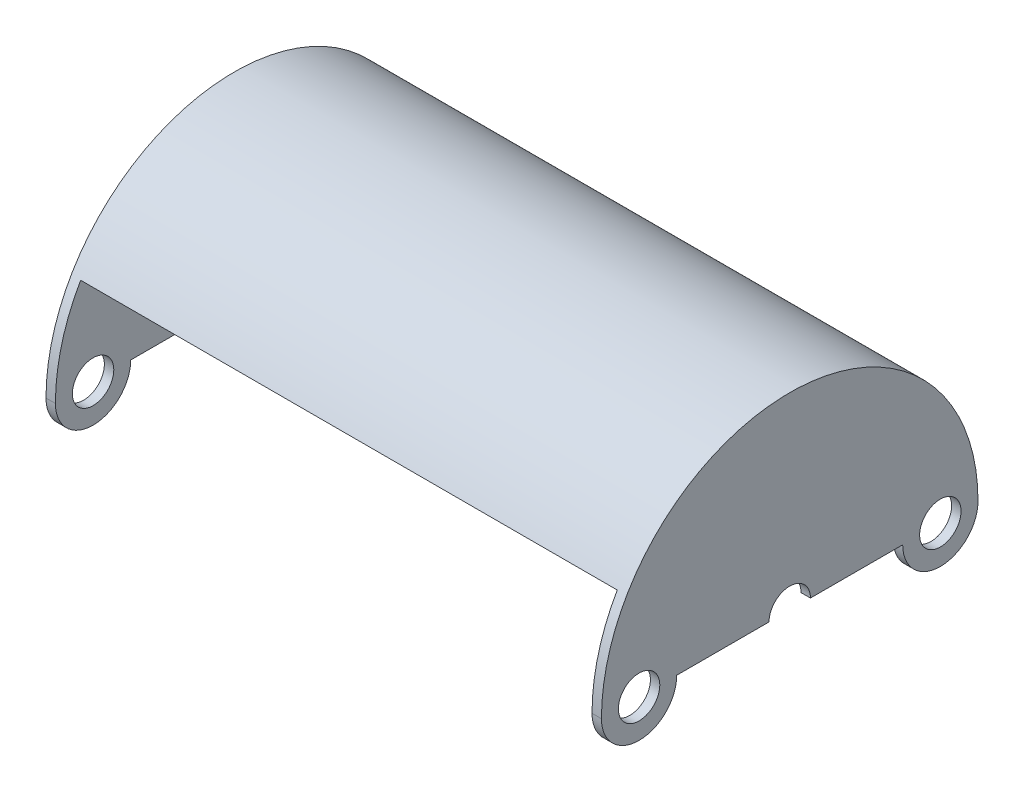
ISO-10303-21;
HEADER;
FILE_DESCRIPTION(('STEP AP214'),'2;1');
FILE_NAME('part.step','',(''),(''),'','','');
FILE_SCHEMA(('AUTOMOTIVE_DESIGN { 1 0 10303 214 1 1 1 1 }'));
ENDSEC;
DATA;
#1=APPLICATION_CONTEXT('core data for automotive mechanical design processes');
#2=APPLICATION_PROTOCOL_DEFINITION('international standard','automotive_design',2000,#1);
#3=PRODUCT_CONTEXT('',#1,'mechanical');
#4=PRODUCT('Part','Part','',(#3));
#5=PRODUCT_RELATED_PRODUCT_CATEGORY('part','',(#4));
#6=PRODUCT_DEFINITION_FORMATION('','',#4);
#7=PRODUCT_DEFINITION_CONTEXT('part definition',#1,'design');
#8=PRODUCT_DEFINITION('design','',#6,#7);
#9=PRODUCT_DEFINITION_SHAPE('','',#8);
#10=(LENGTH_UNIT() NAMED_UNIT(*) SI_UNIT(.MILLI.,.METRE.));
#11=(NAMED_UNIT(*) PLANE_ANGLE_UNIT() SI_UNIT($,.RADIAN.));
#12=(NAMED_UNIT(*) SI_UNIT($,.STERADIAN.) SOLID_ANGLE_UNIT());
#13=UNCERTAINTY_MEASURE_WITH_UNIT(LENGTH_MEASURE(1.E-05),#10,'distance_accuracy_value','');
#14=(GEOMETRIC_REPRESENTATION_CONTEXT(3) GLOBAL_UNCERTAINTY_ASSIGNED_CONTEXT((#13)) GLOBAL_UNIT_ASSIGNED_CONTEXT((#10,
#11,#12)) REPRESENTATION_CONTEXT('',''));
#15=CARTESIAN_POINT('',(0.,0.,0.));
#16=DIRECTION('',(0.,0.,1.));
#17=DIRECTION('',(1.,0.,0.));
#18=AXIS2_PLACEMENT_3D('',#15,#16,#17);
#19=CARTESIAN_POINT('',(45.24375,0.,0.));
#20=DIRECTION('',(-1.,0.,0.));
#21=DIRECTION('',(0.,0.,1.));
#22=AXIS2_PLACEMENT_3D('',#19,#20,#21);
#23=CYLINDRICAL_SURFACE('',#22,30.1625);
#24=CARTESIAN_POINT('',(-45.24375,0.,0.));
#25=DIRECTION('',(1.,0.,0.));
#26=DIRECTION('',(0.,0.,-1.));
#27=AXIS2_PLACEMENT_3D('',#24,#25,#26);
#28=CIRCLE('',#27,30.1625);
#29=CARTESIAN_POINT('',(-45.24375,0.,-30.1625));
#30=VERTEX_POINT('',#29);
#31=CARTESIAN_POINT('',(-45.24375,15.0812499999998,26.1214912416482));
#32=VERTEX_POINT('',#31);
#33=EDGE_CURVE('E308',#30,#32,#28,.T.);
#34=ORIENTED_EDGE('',*,*,#33,.F.);
#35=DIRECTION('',(-1.,0.,0.));
#36=VECTOR('',#35,1.);
#37=CARTESIAN_POINT('',(45.24375,0.,-30.1625));
#38=LINE('',#37,#36);
#39=CARTESIAN_POINT('',(45.24375,0.,-30.1625));
#40=VERTEX_POINT('',#39);
#41=EDGE_CURVE('E11',#40,#30,#38,.T.);
#42=ORIENTED_EDGE('',*,*,#41,.F.);
#43=CARTESIAN_POINT('',(45.24375,0.,0.));
#44=DIRECTION('',(1.,0.,0.));
#45=DIRECTION('',(0.,0.,-1.));
#46=AXIS2_PLACEMENT_3D('',#43,#44,#45);
#47=CIRCLE('',#46,30.1625);
#48=CARTESIAN_POINT('',(45.24375,15.0812499999998,26.1214912416482));
#49=VERTEX_POINT('',#48);
#50=EDGE_CURVE('E309',#40,#49,#47,.T.);
#51=ORIENTED_EDGE('',*,*,#50,.T.);
#52=DIRECTION('',(-1.,0.,0.));
#53=VECTOR('',#52,1.);
#54=CARTESIAN_POINT('',(45.24375,15.0812499999998,26.1214912416482));
#55=LINE('',#54,#53);
#56=EDGE_CURVE('E321',#49,#32,#55,.T.);
#57=ORIENTED_EDGE('',*,*,#56,.T.);
#58=EDGE_LOOP('',(#34,#42,#51,#57));
#59=FACE_BOUND('',#58,.T.);
#60=ADVANCED_FACE('F47',(#59),#23,.F.);
#61=CARTESIAN_POINT('',(45.24375,0.,0.));
#62=DIRECTION('',(0.,1.,0.));
#63=DIRECTION('',(0.,0.,1.));
#64=AXIS2_PLACEMENT_3D('',#61,#62,#63);
#65=PLANE('',#64);
#66=DIRECTION('',(0.,0.,-1.));
#67=VECTOR('',#66,1.);
#68=CARTESIAN_POINT('',(-45.24375,0.,0.));
#69=LINE('',#68,#67);
#70=CARTESIAN_POINT('',(-45.24375,0.,-31.75));
#71=VERTEX_POINT('',#70);
#72=EDGE_CURVE('E324',#30,#71,#69,.T.);
#73=ORIENTED_EDGE('',*,*,#72,.T.);
#74=DIRECTION('',(-1.,0.,0.));
#75=VECTOR('',#74,1.);
#76=CARTESIAN_POINT('',(45.24375,0.,-31.75));
#77=LINE('',#76,#75);
#78=CARTESIAN_POINT('',(45.24375,0.,-31.75));
#79=VERTEX_POINT('',#78);
#80=EDGE_CURVE('E56',#79,#71,#77,.T.);
#81=ORIENTED_EDGE('',*,*,#80,.F.);
#82=DIRECTION('',(0.,0.,-1.));
#83=VECTOR('',#82,1.);
#84=CARTESIAN_POINT('',(45.24375,0.,0.));
#85=LINE('',#84,#83);
#86=EDGE_CURVE('E313',#40,#79,#85,.T.);
#87=ORIENTED_EDGE('',*,*,#86,.F.);
#88=ORIENTED_EDGE('',*,*,#41,.T.);
#89=EDGE_LOOP('',(#73,#81,#87,#88));
#90=FACE_BOUND('',#89,.T.);
#91=ADVANCED_FACE('F342',(#90),#65,.F.);
#92=CARTESIAN_POINT('',(45.24375,0.,0.));
#93=DIRECTION('',(-1.,0.,0.));
#94=DIRECTION('',(0.,0.,1.));
#95=AXIS2_PLACEMENT_3D('',#92,#93,#94);
#96=CYLINDRICAL_SURFACE('',#95,31.75);
#97=ORIENTED_EDGE('',*,*,#80,.T.);
#98=DIRECTION('',(1.,0.,0.));
#99=VECTOR('',#98,1.);
#100=CARTESIAN_POINT('',(-46.83125,0.,-31.75));
#101=LINE('',#100,#99);
#102=CARTESIAN_POINT('',(-46.83125,0.,-31.75));
#103=VERTEX_POINT('',#102);
#104=EDGE_CURVE('E163',#103,#71,#101,.T.);
#105=ORIENTED_EDGE('',*,*,#104,.F.);
#106=CARTESIAN_POINT('',(-46.83125,0.,0.));
#107=DIRECTION('',(1.,0.,0.));
#108=DIRECTION('',(0.,0.,-1.));
#109=AXIS2_PLACEMENT_3D('',#106,#107,#108);
#110=CIRCLE('',#109,31.75);
#111=CARTESIAN_POINT('',(-46.83125,-2.78108394667497E-13,31.75));
#112=VERTEX_POINT('',#111);
#113=EDGE_CURVE('E169',#103,#112,#110,.T.);
#114=ORIENTED_EDGE('',*,*,#113,.T.);
#115=DIRECTION('',(1.,0.,0.));
#116=VECTOR('',#115,1.);
#117=CARTESIAN_POINT('',(-46.83125,-2.78108394667497E-13,31.75));
#118=LINE('',#117,#116);
#119=CARTESIAN_POINT('',(-45.24375,-2.78108394667497E-13,31.75));
#120=VERTEX_POINT('',#119);
#121=EDGE_CURVE('E151',#112,#120,#118,.T.);
#122=ORIENTED_EDGE('',*,*,#121,.T.);
#123=CARTESIAN_POINT('',(-45.24375,0.,0.));
#124=DIRECTION('',(1.,0.,0.));
#125=DIRECTION('',(0.,0.,-1.));
#126=AXIS2_PLACEMENT_3D('',#123,#124,#125);
#127=CIRCLE('',#126,31.75);
#128=CARTESIAN_POINT('',(-45.24375,15.8749999999998,27.496306570156));
#129=VERTEX_POINT('',#128);
#130=EDGE_CURVE('E200',#129,#120,#127,.T.);
#131=ORIENTED_EDGE('',*,*,#130,.F.);
#132=DIRECTION('',(-1.,0.,0.));
#133=VECTOR('',#132,1.);
#134=CARTESIAN_POINT('',(45.24375,15.8749999999998,27.496306570156));
#135=LINE('',#134,#133);
#136=CARTESIAN_POINT('',(45.24375,15.8749999999998,27.496306570156));
#137=VERTEX_POINT('',#136);
#138=EDGE_CURVE('E333',#137,#129,#135,.T.);
#139=ORIENTED_EDGE('',*,*,#138,.F.);
#140=CARTESIAN_POINT('',(45.24375,0.,0.));
#141=DIRECTION('',(1.,0.,0.));
#142=DIRECTION('',(0.,0.,-1.));
#143=AXIS2_PLACEMENT_3D('',#140,#141,#142);
#144=CIRCLE('',#143,31.75);
#145=CARTESIAN_POINT('',(45.24375,-2.78108394667497E-13,31.75));
#146=VERTEX_POINT('',#145);
#147=EDGE_CURVE('E62',#137,#146,#144,.T.);
#148=ORIENTED_EDGE('',*,*,#147,.T.);
#149=DIRECTION('',(-1.,0.,0.));
#150=VECTOR('',#149,1.);
#151=CARTESIAN_POINT('',(46.83125,-2.78108394667497E-13,31.75));
#152=LINE('',#151,#150);
#153=CARTESIAN_POINT('',(46.83125,-2.78108394667497E-13,31.75));
#154=VERTEX_POINT('',#153);
#155=EDGE_CURVE('E266',#154,#146,#152,.T.);
#156=ORIENTED_EDGE('',*,*,#155,.F.);
#157=CARTESIAN_POINT('',(46.83125,0.,0.));
#158=DIRECTION('',(1.,0.,0.));
#159=DIRECTION('',(0.,0.,-1.));
#160=AXIS2_PLACEMENT_3D('',#157,#158,#159);
#161=CIRCLE('',#160,31.75);
#162=CARTESIAN_POINT('',(46.83125,0.,-31.75));
#163=VERTEX_POINT('',#162);
#164=EDGE_CURVE('E263',#163,#154,#161,.T.);
#165=ORIENTED_EDGE('',*,*,#164,.F.);
#166=DIRECTION('',(-1.,0.,0.));
#167=VECTOR('',#166,1.);
#168=CARTESIAN_POINT('',(46.83125,0.,-31.75));
#169=LINE('',#168,#167);
#170=EDGE_CURVE('E288',#163,#79,#169,.T.);
#171=ORIENTED_EDGE('',*,*,#170,.T.);
#172=EDGE_LOOP('',(#97,#105,#114,#122,#131,#139,#148,#156,#165,#171));
#173=FACE_BOUND('',#172,.T.);
#174=ADVANCED_FACE('F178',(#173),#96,.T.);
#175=CARTESIAN_POINT('',(45.24375,0.,0.));
#176=DIRECTION('',(0.,-0.866025403784442,0.499999999999995));
#177=DIRECTION('',(0.,-0.499999999999995,-0.866025403784442));
#178=AXIS2_PLACEMENT_3D('',#175,#176,#177);
#179=PLANE('',#178);
#180=DIRECTION('',(0.,0.499999999999995,0.866025403784442));
#181=VECTOR('',#180,1.);
#182=CARTESIAN_POINT('',(-45.24375,0.,0.));
#183=LINE('',#182,#181);
#184=EDGE_CURVE('E314',#32,#129,#183,.T.);
#185=ORIENTED_EDGE('',*,*,#184,.F.);
#186=ORIENTED_EDGE('',*,*,#56,.F.);
#187=DIRECTION('',(0.,0.499999999999995,0.866025403784442));
#188=VECTOR('',#187,1.);
#189=CARTESIAN_POINT('',(45.24375,0.,0.));
#190=LINE('',#189,#188);
#191=EDGE_CURVE('E317',#49,#137,#190,.T.);
#192=ORIENTED_EDGE('',*,*,#191,.T.);
#193=ORIENTED_EDGE('',*,*,#138,.T.);
#194=EDGE_LOOP('',(#185,#186,#192,#193));
#195=FACE_BOUND('',#194,.T.);
#196=ADVANCED_FACE('F362',(#195),#179,.T.);
#197=CARTESIAN_POINT('',(46.83125,-2.24086679090653E-13,25.4));
#198=DIRECTION('',(1.,0.,0.));
#199=DIRECTION('',(0.,0.,-1.));
#200=AXIS2_PLACEMENT_3D('',#197,#198,#199);
#201=PLANE('',#200);
#202=CARTESIAN_POINT('',(46.83125,-2.24086679090653E-13,25.4));
#203=DIRECTION('',(1.,0.,0.));
#204=DIRECTION('',(0.,0.,-1.));
#205=AXIS2_PLACEMENT_3D('',#202,#203,#204);
#206=CIRCLE('',#205,3.4925);
#207=CARTESIAN_POINT('',(46.83125,-2.24086679090653E-13,21.9075));
#208=VERTEX_POINT('',#207);
#209=EDGE_CURVE('E239',#208,#208,#206,.T.);
#210=ORIENTED_EDGE('',*,*,#209,.F.);
#211=EDGE_LOOP('',(#210));
#212=FACE_BOUND('',#211,.T.);
#213=CARTESIAN_POINT('',(46.83125,-2.24086679090653E-13,25.4));
#214=DIRECTION('',(1.,0.,0.));
#215=DIRECTION('',(0.,0.,-1.));
#216=AXIS2_PLACEMENT_3D('',#213,#214,#215);
#217=CIRCLE('',#216,6.35);
#218=CARTESIAN_POINT('',(46.83125,-2.24086679090653E-13,19.05));
#219=VERTEX_POINT('',#218);
#220=EDGE_CURVE('E247',#154,#219,#217,.T.);
#221=ORIENTED_EDGE('',*,*,#220,.T.);
#222=DIRECTION('',(0.,0.,-1.));
#223=VECTOR('',#222,1.);
#224=CARTESIAN_POINT('',(46.83125,-2.24086679090653E-13,19.05));
#225=LINE('',#224,#223);
#226=CARTESIAN_POINT('',(46.83125,-1.32584618461969E-13,3.4925));
#227=VERTEX_POINT('',#226);
#228=EDGE_CURVE('E251',#219,#227,#225,.T.);
#229=ORIENTED_EDGE('',*,*,#228,.T.);
#230=CARTESIAN_POINT('',(46.83125,0.,0.));
#231=DIRECTION('',(-1.,0.,0.));
#232=DIRECTION('',(0.,0.,-1.));
#233=AXIS2_PLACEMENT_3D('',#230,#231,#232);
#234=CIRCLE('',#233,3.4925);
#235=CARTESIAN_POINT('',(46.83125,0.,-3.4925));
#236=VERTEX_POINT('',#235);
#237=EDGE_CURVE('E254',#227,#236,#234,.T.);
#238=ORIENTED_EDGE('',*,*,#237,.T.);
#239=DIRECTION('',(0.,0.,-1.));
#240=VECTOR('',#239,1.);
#241=CARTESIAN_POINT('',(46.83125,0.,-3.4925));
#242=LINE('',#241,#240);
#243=CARTESIAN_POINT('',(46.83125,0.,-19.05));
#244=VERTEX_POINT('',#243);
#245=EDGE_CURVE('E257',#236,#244,#242,.T.);
#246=ORIENTED_EDGE('',*,*,#245,.T.);
#247=CARTESIAN_POINT('',(46.83125,0.,-25.4));
#248=DIRECTION('',(1.,0.,0.));
#249=DIRECTION('',(0.,0.,-1.));
#250=AXIS2_PLACEMENT_3D('',#247,#248,#249);
#251=CIRCLE('',#250,6.35);
#252=EDGE_CURVE('E260',#244,#163,#251,.T.);
#253=ORIENTED_EDGE('',*,*,#252,.T.);
#254=ORIENTED_EDGE('',*,*,#164,.T.);
#255=EDGE_LOOP('',(#221,#229,#238,#246,#253,#254));
#256=FACE_BOUND('',#255,.T.);
#257=CARTESIAN_POINT('',(46.83125,0.,-25.4));
#258=DIRECTION('',(1.,0.,0.));
#259=DIRECTION('',(0.,0.,-1.));
#260=AXIS2_PLACEMENT_3D('',#257,#258,#259);
#261=CIRCLE('',#260,3.4925);
#262=CARTESIAN_POINT('',(46.83125,0.,-28.8925));
#263=VERTEX_POINT('',#262);
#264=EDGE_CURVE('E231',#263,#263,#261,.T.);
#265=ORIENTED_EDGE('',*,*,#264,.F.);
#266=EDGE_LOOP('',(#265));
#267=FACE_BOUND('',#266,.T.);
#268=ADVANCED_FACE('F380',(#212,#256,#267),#201,.T.);
#269=CARTESIAN_POINT('',(45.24375,-2.24086679090653E-13,25.4));
#270=DIRECTION('',(1.,0.,0.));
#271=DIRECTION('',(0.,0.,-1.));
#272=AXIS2_PLACEMENT_3D('',#269,#270,#271);
#273=PLANE('',#272);
#274=ORIENTED_EDGE('',*,*,#50,.F.);
#275=ORIENTED_EDGE('',*,*,#86,.T.);
#276=CARTESIAN_POINT('',(45.24375,0.,-25.4));
#277=DIRECTION('',(1.,0.,0.));
#278=DIRECTION('',(0.,0.,-1.));
#279=AXIS2_PLACEMENT_3D('',#276,#277,#278);
#280=CIRCLE('',#279,6.35);
#281=CARTESIAN_POINT('',(45.24375,0.,-19.05));
#282=VERTEX_POINT('',#281);
#283=EDGE_CURVE('E279',#282,#79,#280,.T.);
#284=ORIENTED_EDGE('',*,*,#283,.F.);
#285=DIRECTION('',(0.,0.,-1.));
#286=VECTOR('',#285,1.);
#287=CARTESIAN_POINT('',(45.24375,0.,-3.4925));
#288=LINE('',#287,#286);
#289=CARTESIAN_POINT('',(45.24375,0.,-3.4925));
#290=VERTEX_POINT('',#289);
#291=EDGE_CURVE('E276',#290,#282,#288,.T.);
#292=ORIENTED_EDGE('',*,*,#291,.F.);
#293=CARTESIAN_POINT('',(45.24375,0.,0.));
#294=DIRECTION('',(-1.,0.,0.));
#295=DIRECTION('',(0.,0.,-1.));
#296=AXIS2_PLACEMENT_3D('',#293,#294,#295);
#297=CIRCLE('',#296,3.4925);
#298=CARTESIAN_POINT('',(45.24375,-1.32584618461969E-13,3.4925));
#299=VERTEX_POINT('',#298);
#300=EDGE_CURVE('E273',#299,#290,#297,.T.);
#301=ORIENTED_EDGE('',*,*,#300,.F.);
#302=DIRECTION('',(0.,0.,-1.));
#303=VECTOR('',#302,1.);
#304=CARTESIAN_POINT('',(45.24375,-2.24086679090653E-13,19.05));
#305=LINE('',#304,#303);
#306=CARTESIAN_POINT('',(45.24375,-2.24086679090653E-13,19.05));
#307=VERTEX_POINT('',#306);
#308=EDGE_CURVE('E270',#307,#299,#305,.T.);
#309=ORIENTED_EDGE('',*,*,#308,.F.);
#310=CARTESIAN_POINT('',(45.24375,-2.24086679090653E-13,25.4));
#311=DIRECTION('',(1.,0.,0.));
#312=DIRECTION('',(0.,0.,-1.));
#313=AXIS2_PLACEMENT_3D('',#310,#311,#312);
#314=CIRCLE('',#313,6.35);
#315=EDGE_CURVE('E243',#146,#307,#314,.T.);
#316=ORIENTED_EDGE('',*,*,#315,.F.);
#317=ORIENTED_EDGE('',*,*,#147,.F.);
#318=ORIENTED_EDGE('',*,*,#191,.F.);
#319=EDGE_LOOP('',(#274,#275,#284,#292,#301,#309,#316,#317,#318));
#320=FACE_BOUND('',#319,.T.);
#321=CARTESIAN_POINT('',(45.24375,-2.24086679090653E-13,25.4));
#322=DIRECTION('',(1.,0.,0.));
#323=DIRECTION('',(0.,0.,-1.));
#324=AXIS2_PLACEMENT_3D('',#321,#322,#323);
#325=CIRCLE('',#324,3.4925);
#326=CARTESIAN_POINT('',(45.24375,-2.24086679090653E-13,21.9075));
#327=VERTEX_POINT('',#326);
#328=EDGE_CURVE('E235',#327,#327,#325,.T.);
#329=ORIENTED_EDGE('',*,*,#328,.T.);
#330=EDGE_LOOP('',(#329));
#331=FACE_BOUND('',#330,.T.);
#332=CARTESIAN_POINT('',(45.24375,0.,-25.4));
#333=DIRECTION('',(1.,0.,0.));
#334=DIRECTION('',(0.,0.,-1.));
#335=AXIS2_PLACEMENT_3D('',#332,#333,#334);
#336=CIRCLE('',#335,3.4925);
#337=CARTESIAN_POINT('',(45.24375,0.,-28.8925));
#338=VERTEX_POINT('',#337);
#339=EDGE_CURVE('E162',#338,#338,#336,.T.);
#340=ORIENTED_EDGE('',*,*,#339,.T.);
#341=EDGE_LOOP('',(#340));
#342=FACE_BOUND('',#341,.T.);
#343=ADVANCED_FACE('F364',(#320,#331,#342),#273,.F.);
#344=CARTESIAN_POINT('',(46.83125,-2.24086679090653E-13,25.4));
#345=DIRECTION('',(-1.,0.,0.));
#346=DIRECTION('',(0.,0.,1.));
#347=AXIS2_PLACEMENT_3D('',#344,#345,#346);
#348=CYLINDRICAL_SURFACE('',#347,6.35);
#349=ORIENTED_EDGE('',*,*,#315,.T.);
#350=DIRECTION('',(-1.,0.,0.));
#351=VECTOR('',#350,1.);
#352=CARTESIAN_POINT('',(46.83125,-2.24086679090653E-13,19.05));
#353=LINE('',#352,#351);
#354=EDGE_CURVE('E304',#219,#307,#353,.T.);
#355=ORIENTED_EDGE('',*,*,#354,.F.);
#356=ORIENTED_EDGE('',*,*,#220,.F.);
#357=ORIENTED_EDGE('',*,*,#155,.T.);
#358=EDGE_LOOP('',(#349,#355,#356,#357));
#359=FACE_BOUND('',#358,.T.);
#360=ADVANCED_FACE('F381',(#359),#348,.T.);
#361=CARTESIAN_POINT('',(46.83125,-2.24086679090653E-13,19.05));
#362=DIRECTION('',(0.,1.,0.));
#363=DIRECTION('',(0.,0.,1.));
#364=AXIS2_PLACEMENT_3D('',#361,#362,#363);
#365=PLANE('',#364);
#366=ORIENTED_EDGE('',*,*,#308,.T.);
#367=DIRECTION('',(-1.,0.,0.));
#368=VECTOR('',#367,1.);
#369=CARTESIAN_POINT('',(46.83125,-1.32584618461969E-13,3.4925));
#370=LINE('',#369,#368);
#371=EDGE_CURVE('E300',#227,#299,#370,.T.);
#372=ORIENTED_EDGE('',*,*,#371,.F.);
#373=ORIENTED_EDGE('',*,*,#228,.F.);
#374=ORIENTED_EDGE('',*,*,#354,.T.);
#375=EDGE_LOOP('',(#366,#372,#373,#374));
#376=FACE_BOUND('',#375,.T.);
#377=ADVANCED_FACE('F384',(#376),#365,.F.);
#378=CARTESIAN_POINT('',(46.83125,0.,0.));
#379=DIRECTION('',(-1.,0.,0.));
#380=DIRECTION('',(0.,0.,1.));
#381=AXIS2_PLACEMENT_3D('',#378,#379,#380);
#382=CYLINDRICAL_SURFACE('',#381,3.4925);
#383=ORIENTED_EDGE('',*,*,#300,.T.);
#384=DIRECTION('',(-1.,0.,0.));
#385=VECTOR('',#384,1.);
#386=CARTESIAN_POINT('',(46.83125,0.,-3.4925));
#387=LINE('',#386,#385);
#388=EDGE_CURVE('E296',#236,#290,#387,.T.);
#389=ORIENTED_EDGE('',*,*,#388,.F.);
#390=ORIENTED_EDGE('',*,*,#237,.F.);
#391=ORIENTED_EDGE('',*,*,#371,.T.);
#392=EDGE_LOOP('',(#383,#389,#390,#391));
#393=FACE_BOUND('',#392,.T.);
#394=ADVANCED_FACE('F388',(#393),#382,.F.);
#395=CARTESIAN_POINT('',(46.83125,0.,-3.4925));
#396=DIRECTION('',(0.,1.,0.));
#397=DIRECTION('',(0.,0.,1.));
#398=AXIS2_PLACEMENT_3D('',#395,#396,#397);
#399=PLANE('',#398);
#400=ORIENTED_EDGE('',*,*,#291,.T.);
#401=DIRECTION('',(-1.,0.,0.));
#402=VECTOR('',#401,1.);
#403=CARTESIAN_POINT('',(46.83125,0.,-19.05));
#404=LINE('',#403,#402);
#405=EDGE_CURVE('E292',#244,#282,#404,.T.);
#406=ORIENTED_EDGE('',*,*,#405,.F.);
#407=ORIENTED_EDGE('',*,*,#245,.F.);
#408=ORIENTED_EDGE('',*,*,#388,.T.);
#409=EDGE_LOOP('',(#400,#406,#407,#408));
#410=FACE_BOUND('',#409,.T.);
#411=ADVANCED_FACE('F392',(#410),#399,.F.);
#412=CARTESIAN_POINT('',(46.83125,0.,-25.4));
#413=DIRECTION('',(-1.,0.,0.));
#414=DIRECTION('',(0.,0.,1.));
#415=AXIS2_PLACEMENT_3D('',#412,#413,#414);
#416=CYLINDRICAL_SURFACE('',#415,6.35);
#417=ORIENTED_EDGE('',*,*,#283,.T.);
#418=ORIENTED_EDGE('',*,*,#170,.F.);
#419=ORIENTED_EDGE('',*,*,#252,.F.);
#420=ORIENTED_EDGE('',*,*,#405,.T.);
#421=EDGE_LOOP('',(#417,#418,#419,#420));
#422=FACE_BOUND('',#421,.T.);
#423=ADVANCED_FACE('F396',(#422),#416,.T.);
#424=CARTESIAN_POINT('',(46.83125,-2.24086679090653E-13,25.4));
#425=DIRECTION('',(-1.,0.,0.));
#426=DIRECTION('',(0.,0.,1.));
#427=AXIS2_PLACEMENT_3D('',#424,#425,#426);
#428=CYLINDRICAL_SURFACE('',#427,3.4925);
#429=ORIENTED_EDGE('',*,*,#209,.T.);
#430=EDGE_LOOP('',(#429));
#431=FACE_BOUND('',#430,.T.);
#432=ORIENTED_EDGE('',*,*,#328,.F.);
#433=EDGE_LOOP('',(#432));
#434=FACE_BOUND('',#433,.T.);
#435=ADVANCED_FACE('F400',(#431,#434),#428,.F.);
#436=CARTESIAN_POINT('',(46.83125,0.,-25.4));
#437=DIRECTION('',(-1.,0.,0.));
#438=DIRECTION('',(0.,0.,1.));
#439=AXIS2_PLACEMENT_3D('',#436,#437,#438);
#440=CYLINDRICAL_SURFACE('',#439,3.4925);
#441=ORIENTED_EDGE('',*,*,#264,.T.);
#442=EDGE_LOOP('',(#441));
#443=FACE_BOUND('',#442,.T.);
#444=ORIENTED_EDGE('',*,*,#339,.F.);
#445=EDGE_LOOP('',(#444));
#446=FACE_BOUND('',#445,.T.);
#447=ADVANCED_FACE('F409',(#443,#446),#440,.F.);
#448=CARTESIAN_POINT('',(-45.24375,-2.24086679090653E-13,25.4));
#449=DIRECTION('',(-1.,0.,0.));
#450=DIRECTION('',(0.,0.,-1.));
#451=AXIS2_PLACEMENT_3D('',#448,#449,#450);
#452=PLANE('',#451);
#453=CARTESIAN_POINT('',(-45.24375,0.,-25.4));
#454=DIRECTION('',(1.,0.,0.));
#455=DIRECTION('',(0.,0.,-1.));
#456=AXIS2_PLACEMENT_3D('',#453,#454,#455);
#457=CIRCLE('',#456,3.4925);
#458=CARTESIAN_POINT('',(-45.24375,0.,-28.8925));
#459=VERTEX_POINT('',#458);
#460=EDGE_CURVE('E444',#459,#459,#457,.T.);
#461=ORIENTED_EDGE('',*,*,#460,.F.);
#462=EDGE_LOOP('',(#461));
#463=FACE_BOUND('',#462,.T.);
#464=CARTESIAN_POINT('',(-45.24375,-2.24086679090653E-13,25.4));
#465=DIRECTION('',(1.,0.,0.));
#466=DIRECTION('',(0.,0.,-1.));
#467=AXIS2_PLACEMENT_3D('',#464,#465,#466);
#468=CIRCLE('',#467,3.4925);
#469=CARTESIAN_POINT('',(-45.24375,-2.24086679090653E-13,21.9075));
#470=VERTEX_POINT('',#469);
#471=EDGE_CURVE('E448',#470,#470,#468,.T.);
#472=ORIENTED_EDGE('',*,*,#471,.F.);
#473=EDGE_LOOP('',(#472));
#474=FACE_BOUND('',#473,.T.);
#475=ORIENTED_EDGE('',*,*,#33,.T.);
#476=ORIENTED_EDGE('',*,*,#184,.T.);
#477=ORIENTED_EDGE('',*,*,#130,.T.);
#478=CARTESIAN_POINT('',(-45.24375,-2.24086679090653E-13,25.4));
#479=DIRECTION('',(1.,0.,0.));
#480=DIRECTION('',(0.,0.,-1.));
#481=AXIS2_PLACEMENT_3D('',#478,#479,#480);
#482=CIRCLE('',#481,6.35);
#483=CARTESIAN_POINT('',(-45.24375,-2.24086679090653E-13,19.05));
#484=VERTEX_POINT('',#483);
#485=EDGE_CURVE('E157',#120,#484,#482,.T.);
#486=ORIENTED_EDGE('',*,*,#485,.T.);
#487=DIRECTION('',(0.,0.,-1.));
#488=VECTOR('',#487,1.);
#489=CARTESIAN_POINT('',(-45.24375,-2.24086679090653E-13,19.05));
#490=LINE('',#489,#488);
#491=CARTESIAN_POINT('',(-45.24375,-1.32584618461969E-13,3.4925));
#492=VERTEX_POINT('',#491);
#493=EDGE_CURVE('E175',#484,#492,#490,.T.);
#494=ORIENTED_EDGE('',*,*,#493,.T.);
#495=CARTESIAN_POINT('',(-45.24375,0.,0.));
#496=DIRECTION('',(-1.,0.,0.));
#497=DIRECTION('',(0.,0.,-1.));
#498=AXIS2_PLACEMENT_3D('',#495,#496,#497);
#499=CIRCLE('',#498,3.4925);
#500=CARTESIAN_POINT('',(-45.24375,0.,-3.4925));
#501=VERTEX_POINT('',#500);
#502=EDGE_CURVE('E211',#492,#501,#499,.T.);
#503=ORIENTED_EDGE('',*,*,#502,.T.);
#504=DIRECTION('',(0.,0.,-1.));
#505=VECTOR('',#504,1.);
#506=CARTESIAN_POINT('',(-45.24375,0.,-3.4925));
#507=LINE('',#506,#505);
#508=CARTESIAN_POINT('',(-45.24375,0.,-19.05));
#509=VERTEX_POINT('',#508);
#510=EDGE_CURVE('E207',#501,#509,#507,.T.);
#511=ORIENTED_EDGE('',*,*,#510,.T.);
#512=CARTESIAN_POINT('',(-45.24375,0.,-25.4));
#513=DIRECTION('',(1.,0.,0.));
#514=DIRECTION('',(0.,0.,-1.));
#515=AXIS2_PLACEMENT_3D('',#512,#513,#514);
#516=CIRCLE('',#515,6.35);
#517=EDGE_CURVE('E204',#509,#71,#516,.T.);
#518=ORIENTED_EDGE('',*,*,#517,.T.);
#519=ORIENTED_EDGE('',*,*,#72,.F.);
#520=EDGE_LOOP('',(#475,#476,#477,#486,#494,#503,#511,#518,#519));
#521=FACE_BOUND('',#520,.T.);
#522=ADVANCED_FACE('F346',(#463,#474,#521),#452,.F.);
#523=CARTESIAN_POINT('',(-46.83125,-2.24086679090653E-13,25.4));
#524=DIRECTION('',(1.,0.,0.));
#525=DIRECTION('',(0.,0.,-1.));
#526=AXIS2_PLACEMENT_3D('',#523,#524,#525);
#527=CYLINDRICAL_SURFACE('',#526,6.35);
#528=ORIENTED_EDGE('',*,*,#485,.F.);
#529=ORIENTED_EDGE('',*,*,#121,.F.);
#530=CARTESIAN_POINT('',(-46.83125,-2.24086679090653E-13,25.4));
#531=DIRECTION('',(1.,0.,0.));
#532=DIRECTION('',(0.,0.,-1.));
#533=AXIS2_PLACEMENT_3D('',#530,#531,#532);
#534=CIRCLE('',#533,6.35);
#535=CARTESIAN_POINT('',(-46.83125,-2.24086679090653E-13,19.05));
#536=VERTEX_POINT('',#535);
#537=EDGE_CURVE('E154',#112,#536,#534,.T.);
#538=ORIENTED_EDGE('',*,*,#537,.T.);
#539=DIRECTION('',(1.,0.,0.));
#540=VECTOR('',#539,1.);
#541=CARTESIAN_POINT('',(-46.83125,-2.24086679090653E-13,19.05));
#542=LINE('',#541,#540);
#543=EDGE_CURVE('E197',#536,#484,#542,.T.);
#544=ORIENTED_EDGE('',*,*,#543,.T.);
#545=EDGE_LOOP('',(#528,#529,#538,#544));
#546=FACE_BOUND('',#545,.T.);
#547=ADVANCED_FACE('F153',(#546),#527,.T.);
#548=CARTESIAN_POINT('',(-46.83125,0.,-25.4));
#549=DIRECTION('',(1.,0.,0.));
#550=DIRECTION('',(0.,0.,-1.));
#551=AXIS2_PLACEMENT_3D('',#548,#549,#550);
#552=CYLINDRICAL_SURFACE('',#551,6.35);
#553=ORIENTED_EDGE('',*,*,#517,.F.);
#554=DIRECTION('',(1.,0.,0.));
#555=VECTOR('',#554,1.);
#556=CARTESIAN_POINT('',(-46.83125,0.,-19.05));
#557=LINE('',#556,#555);
#558=CARTESIAN_POINT('',(-46.83125,0.,-19.05));
#559=VERTEX_POINT('',#558);
#560=EDGE_CURVE('E226',#559,#509,#557,.T.);
#561=ORIENTED_EDGE('',*,*,#560,.F.);
#562=CARTESIAN_POINT('',(-46.83125,0.,-25.4));
#563=DIRECTION('',(1.,0.,0.));
#564=DIRECTION('',(0.,0.,-1.));
#565=AXIS2_PLACEMENT_3D('',#562,#563,#564);
#566=CIRCLE('',#565,6.35);
#567=EDGE_CURVE('E181',#559,#103,#566,.T.);
#568=ORIENTED_EDGE('',*,*,#567,.T.);
#569=ORIENTED_EDGE('',*,*,#104,.T.);
#570=EDGE_LOOP('',(#553,#561,#568,#569));
#571=FACE_BOUND('',#570,.T.);
#572=ADVANCED_FACE('F350',(#571),#552,.T.);
#573=CARTESIAN_POINT('',(-46.83125,0.,-3.4925));
#574=DIRECTION('',(0.,-1.,0.));
#575=DIRECTION('',(0.,0.,-1.));
#576=AXIS2_PLACEMENT_3D('',#573,#574,#575);
#577=PLANE('',#576);
#578=ORIENTED_EDGE('',*,*,#510,.F.);
#579=DIRECTION('',(1.,0.,0.));
#580=VECTOR('',#579,1.);
#581=CARTESIAN_POINT('',(-46.83125,0.,-3.4925));
#582=LINE('',#581,#580);
#583=CARTESIAN_POINT('',(-46.83125,0.,-3.4925));
#584=VERTEX_POINT('',#583);
#585=EDGE_CURVE('E223',#584,#501,#582,.T.);
#586=ORIENTED_EDGE('',*,*,#585,.F.);
#587=DIRECTION('',(0.,0.,-1.));
#588=VECTOR('',#587,1.);
#589=CARTESIAN_POINT('',(-46.83125,0.,-3.4925));
#590=LINE('',#589,#588);
#591=EDGE_CURVE('E184',#584,#559,#590,.T.);
#592=ORIENTED_EDGE('',*,*,#591,.T.);
#593=ORIENTED_EDGE('',*,*,#560,.T.);
#594=EDGE_LOOP('',(#578,#586,#592,#593));
#595=FACE_BOUND('',#594,.T.);
#596=ADVANCED_FACE('F353',(#595),#577,.T.);
#597=CARTESIAN_POINT('',(-46.83125,0.,0.));
#598=DIRECTION('',(1.,0.,0.));
#599=DIRECTION('',(0.,0.,-1.));
#600=AXIS2_PLACEMENT_3D('',#597,#598,#599);
#601=CYLINDRICAL_SURFACE('',#600,3.4925);
#602=ORIENTED_EDGE('',*,*,#502,.F.);
#603=DIRECTION('',(1.,0.,0.));
#604=VECTOR('',#603,1.);
#605=CARTESIAN_POINT('',(-46.83125,-1.32584618461969E-13,3.4925));
#606=LINE('',#605,#604);
#607=CARTESIAN_POINT('',(-46.83125,-1.32584618461969E-13,3.4925));
#608=VERTEX_POINT('',#607);
#609=EDGE_CURVE('E220',#608,#492,#606,.T.);
#610=ORIENTED_EDGE('',*,*,#609,.F.);
#611=CARTESIAN_POINT('',(-46.83125,0.,0.));
#612=DIRECTION('',(-1.,0.,0.));
#613=DIRECTION('',(0.,0.,-1.));
#614=AXIS2_PLACEMENT_3D('',#611,#612,#613);
#615=CIRCLE('',#614,3.4925);
#616=EDGE_CURVE('E191',#608,#584,#615,.T.);
#617=ORIENTED_EDGE('',*,*,#616,.T.);
#618=ORIENTED_EDGE('',*,*,#585,.T.);
#619=EDGE_LOOP('',(#602,#610,#617,#618));
#620=FACE_BOUND('',#619,.T.);
#621=ADVANCED_FACE('F356',(#620),#601,.F.);
#622=CARTESIAN_POINT('',(-46.83125,-2.24086679090653E-13,19.05));
#623=DIRECTION('',(0.,-1.,0.));
#624=DIRECTION('',(0.,0.,-1.));
#625=AXIS2_PLACEMENT_3D('',#622,#623,#624);
#626=PLANE('',#625);
#627=ORIENTED_EDGE('',*,*,#493,.F.);
#628=ORIENTED_EDGE('',*,*,#543,.F.);
#629=DIRECTION('',(0.,0.,-1.));
#630=VECTOR('',#629,1.);
#631=CARTESIAN_POINT('',(-46.83125,-2.24086679090653E-13,19.05));
#632=LINE('',#631,#630);
#633=EDGE_CURVE('E173',#536,#608,#632,.T.);
#634=ORIENTED_EDGE('',*,*,#633,.T.);
#635=ORIENTED_EDGE('',*,*,#609,.T.);
#636=EDGE_LOOP('',(#627,#628,#634,#635));
#637=FACE_BOUND('',#636,.T.);
#638=ADVANCED_FACE('F359',(#637),#626,.T.);
#639=CARTESIAN_POINT('',(-46.83125,-2.24086679090653E-13,25.4));
#640=DIRECTION('',(-1.,0.,0.));
#641=DIRECTION('',(0.,0.,-1.));
#642=AXIS2_PLACEMENT_3D('',#639,#640,#641);
#643=PLANE('',#642);
#644=CARTESIAN_POINT('',(-46.83125,0.,-25.4));
#645=DIRECTION('',(1.,0.,0.));
#646=DIRECTION('',(0.,0.,-1.));
#647=AXIS2_PLACEMENT_3D('',#644,#645,#646);
#648=CIRCLE('',#647,3.4925);
#649=CARTESIAN_POINT('',(-46.83125,0.,-28.8925));
#650=VERTEX_POINT('',#649);
#651=EDGE_CURVE('E441',#650,#650,#648,.T.);
#652=ORIENTED_EDGE('',*,*,#651,.T.);
#653=EDGE_LOOP('',(#652));
#654=FACE_BOUND('',#653,.T.);
#655=CARTESIAN_POINT('',(-46.83125,-2.24086679090653E-13,25.4));
#656=DIRECTION('',(1.,0.,0.));
#657=DIRECTION('',(0.,0.,-1.));
#658=AXIS2_PLACEMENT_3D('',#655,#656,#657);
#659=CIRCLE('',#658,3.4925);
#660=CARTESIAN_POINT('',(-46.83125,-2.24086679090653E-13,21.9075));
#661=VERTEX_POINT('',#660);
#662=EDGE_CURVE('E201',#661,#661,#659,.T.);
#663=ORIENTED_EDGE('',*,*,#662,.T.);
#664=EDGE_LOOP('',(#663));
#665=FACE_BOUND('',#664,.T.);
#666=ORIENTED_EDGE('',*,*,#537,.F.);
#667=ORIENTED_EDGE('',*,*,#113,.F.);
#668=ORIENTED_EDGE('',*,*,#567,.F.);
#669=ORIENTED_EDGE('',*,*,#591,.F.);
#670=ORIENTED_EDGE('',*,*,#616,.F.);
#671=ORIENTED_EDGE('',*,*,#633,.F.);
#672=EDGE_LOOP('',(#666,#667,#668,#669,#670,#671));
#673=FACE_BOUND('',#672,.T.);
#674=ADVANCED_FACE('F167',(#654,#665,#673),#643,.T.);
#675=CARTESIAN_POINT('',(-46.83125,-2.24086679090653E-13,25.4));
#676=DIRECTION('',(1.,0.,0.));
#677=DIRECTION('',(0.,0.,-1.));
#678=AXIS2_PLACEMENT_3D('',#675,#676,#677);
#679=CYLINDRICAL_SURFACE('',#678,3.4925);
#680=ORIENTED_EDGE('',*,*,#662,.F.);
#681=EDGE_LOOP('',(#680));
#682=FACE_BOUND('',#681,.T.);
#683=ORIENTED_EDGE('',*,*,#471,.T.);
#684=EDGE_LOOP('',(#683));
#685=FACE_BOUND('',#684,.T.);
#686=ADVANCED_FACE('F428',(#682,#685),#679,.F.);
#687=CARTESIAN_POINT('',(-46.83125,0.,-25.4));
#688=DIRECTION('',(1.,0.,0.));
#689=DIRECTION('',(0.,0.,-1.));
#690=AXIS2_PLACEMENT_3D('',#687,#688,#689);
#691=CYLINDRICAL_SURFACE('',#690,3.4925);
#692=ORIENTED_EDGE('',*,*,#651,.F.);
#693=EDGE_LOOP('',(#692));
#694=FACE_BOUND('',#693,.T.);
#695=ORIENTED_EDGE('',*,*,#460,.T.);
#696=EDGE_LOOP('',(#695));
#697=FACE_BOUND('',#696,.T.);
#698=ADVANCED_FACE('F432',(#694,#697),#691,.F.);
#699=CLOSED_SHELL('',(#60,#91,#174,#196,#268,#343,#360,#377,#394,#411,#423,#435,#447,#522,#547,
#572,#596,#621,#638,#674,#686,#698));
#700=MANIFOLD_SOLID_BREP('B2',#699);
#701=ADVANCED_BREP_SHAPE_REPRESENTATION('',(#18,#700),#14);
#702=SHAPE_DEFINITION_REPRESENTATION(#9,#701);
ENDSEC;
END-ISO-10303-21;
